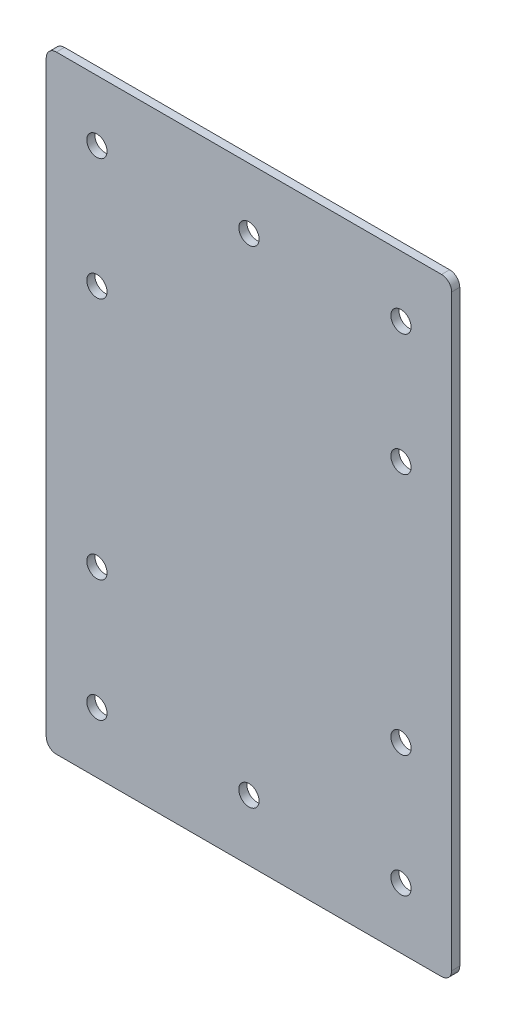
ISO-10303-21;
HEADER;
FILE_DESCRIPTION(('STEP AP214'),'2;1');
FILE_NAME('part.step','',(''),(''),'','','');
FILE_SCHEMA(('AUTOMOTIVE_DESIGN { 1 0 10303 214 1 1 1 1 }'));
ENDSEC;
DATA;
#1=APPLICATION_CONTEXT('core data for automotive mechanical design processes');
#2=APPLICATION_PROTOCOL_DEFINITION('international standard','automotive_design',2000,#1);
#3=PRODUCT_CONTEXT('',#1,'mechanical');
#4=PRODUCT('Part','Part','',(#3));
#5=PRODUCT_RELATED_PRODUCT_CATEGORY('part','',(#4));
#6=PRODUCT_DEFINITION_FORMATION('','',#4);
#7=PRODUCT_DEFINITION_CONTEXT('part definition',#1,'design');
#8=PRODUCT_DEFINITION('design','',#6,#7);
#9=PRODUCT_DEFINITION_SHAPE('','',#8);
#10=(LENGTH_UNIT() NAMED_UNIT(*) SI_UNIT(.MILLI.,.METRE.));
#11=(NAMED_UNIT(*) PLANE_ANGLE_UNIT() SI_UNIT($,.RADIAN.));
#12=(NAMED_UNIT(*) SI_UNIT($,.STERADIAN.) SOLID_ANGLE_UNIT());
#13=UNCERTAINTY_MEASURE_WITH_UNIT(LENGTH_MEASURE(1.E-05),#10,'distance_accuracy_value','');
#14=(GEOMETRIC_REPRESENTATION_CONTEXT(3) GLOBAL_UNCERTAINTY_ASSIGNED_CONTEXT((#13)) GLOBAL_UNIT_ASSIGNED_CONTEXT((#10,
#11,#12)) REPRESENTATION_CONTEXT('',''));
#15=CARTESIAN_POINT('',(0.,0.,0.));
#16=DIRECTION('',(0.,0.,1.));
#17=DIRECTION('',(1.,0.,0.));
#18=AXIS2_PLACEMENT_3D('',#15,#16,#17);
#19=CARTESIAN_POINT('',(499.999999999999,-150.,175.));
#20=DIRECTION('',(-1.,0.,0.));
#21=DIRECTION('',(0.,-1.,0.));
#22=AXIS2_PLACEMENT_3D('',#19,#20,#21);
#23=PLANE('',#22);
#24=DIRECTION('',(0.,1.,0.));
#25=VECTOR('',#24,1.);
#26=CARTESIAN_POINT('',(499.999999999999,-150.,179.));
#27=LINE('',#26,#25);
#28=CARTESIAN_POINT('',(499.999999999999,-95.,179.));
#29=VERTEX_POINT('',#28);
#30=CARTESIAN_POINT('',(499.999999999999,195.,179.));
#31=VERTEX_POINT('',#30);
#32=EDGE_CURVE('E128',#29,#31,#27,.T.);
#33=ORIENTED_EDGE('',*,*,#32,.F.);
#34=DIRECTION('',(0.,0.,1.));
#35=VECTOR('',#34,1.);
#36=CARTESIAN_POINT('',(499.999999999999,-95.,175.));
#37=LINE('',#36,#35);
#38=CARTESIAN_POINT('',(499.999999999999,-95.,175.));
#39=VERTEX_POINT('',#38);
#40=EDGE_CURVE('E147',#29,#39,#37,.F.);
#41=ORIENTED_EDGE('',*,*,#40,.T.);
#42=DIRECTION('',(0.,1.,0.));
#43=VECTOR('',#42,1.);
#44=CARTESIAN_POINT('',(499.999999999999,-150.,175.));
#45=LINE('',#44,#43);
#46=CARTESIAN_POINT('',(499.999999999999,195.,175.));
#47=VERTEX_POINT('',#46);
#48=EDGE_CURVE('E120',#39,#47,#45,.T.);
#49=ORIENTED_EDGE('',*,*,#48,.T.);
#50=DIRECTION('',(0.,0.,1.));
#51=VECTOR('',#50,1.);
#52=CARTESIAN_POINT('',(499.999999999999,195.,175.));
#53=LINE('',#52,#51);
#54=EDGE_CURVE('E108',#47,#31,#53,.T.);
#55=ORIENTED_EDGE('',*,*,#54,.T.);
#56=EDGE_LOOP('',(#33,#41,#49,#55));
#57=FACE_BOUND('',#56,.T.);
#58=ADVANCED_FACE('F34',(#57),#23,.F.);
#59=CARTESIAN_POINT('',(299.999999999999,-150.,179.));
#60=DIRECTION('',(0.,0.,-1.));
#61=DIRECTION('',(0.,1.,0.));
#62=AXIS2_PLACEMENT_3D('',#59,#60,#61);
#63=PLANE('',#62);
#64=CARTESIAN_POINT('',(325.000000000002,-70.,179.));
#65=DIRECTION('',(0.,0.,1.));
#66=DIRECTION('',(1.,0.,0.));
#67=AXIS2_PLACEMENT_3D('',#64,#65,#66);
#68=CIRCLE('',#67,5.00000000000005);
#69=CARTESIAN_POINT('',(330.000000000002,-70.,179.));
#70=VERTEX_POINT('',#69);
#71=EDGE_CURVE('E184',#70,#70,#68,.T.);
#72=ORIENTED_EDGE('',*,*,#71,.F.);
#73=EDGE_LOOP('',(#72));
#74=FACE_BOUND('',#73,.T.);
#75=CARTESIAN_POINT('',(325.,110.,179.));
#76=DIRECTION('',(0.,0.,1.));
#77=DIRECTION('',(1.,0.,0.));
#78=AXIS2_PLACEMENT_3D('',#75,#76,#77);
#79=CIRCLE('',#78,5.00000000000011);
#80=CARTESIAN_POINT('',(330.,110.,179.));
#81=VERTEX_POINT('',#80);
#82=EDGE_CURVE('E192',#81,#81,#79,.T.);
#83=ORIENTED_EDGE('',*,*,#82,.F.);
#84=EDGE_LOOP('',(#83));
#85=FACE_BOUND('',#84,.T.);
#86=CARTESIAN_POINT('',(475.,110.,179.));
#87=DIRECTION('',(0.,0.,1.));
#88=DIRECTION('',(1.,0.,0.));
#89=AXIS2_PLACEMENT_3D('',#86,#87,#88);
#90=CIRCLE('',#89,5.00000000000005);
#91=CARTESIAN_POINT('',(480.,110.,179.));
#92=VERTEX_POINT('',#91);
#93=EDGE_CURVE('E183',#92,#92,#90,.T.);
#94=ORIENTED_EDGE('',*,*,#93,.F.);
#95=EDGE_LOOP('',(#94));
#96=FACE_BOUND('',#95,.T.);
#97=CARTESIAN_POINT('',(475.000000000001,-9.99999999999997,179.));
#98=DIRECTION('',(0.,0.,1.));
#99=DIRECTION('',(1.,0.,0.));
#100=AXIS2_PLACEMENT_3D('',#97,#98,#99);
#101=CIRCLE('',#100,5.00000000000005);
#102=CARTESIAN_POINT('',(480.000000000001,-9.99999999999997,179.));
#103=VERTEX_POINT('',#102);
#104=EDGE_CURVE('E169',#103,#103,#101,.T.);
#105=ORIENTED_EDGE('',*,*,#104,.F.);
#106=EDGE_LOOP('',(#105));
#107=FACE_BOUND('',#106,.T.);
#108=CARTESIAN_POINT('',(325.000000000001,-9.99999999999997,179.));
#109=DIRECTION('',(0.,0.,1.));
#110=DIRECTION('',(1.,0.,0.));
#111=AXIS2_PLACEMENT_3D('',#108,#109,#110);
#112=CIRCLE('',#111,5.00000000000005);
#113=CARTESIAN_POINT('',(330.000000000001,-9.99999999999997,179.));
#114=VERTEX_POINT('',#113);
#115=EDGE_CURVE('E177',#114,#114,#112,.T.);
#116=ORIENTED_EDGE('',*,*,#115,.F.);
#117=EDGE_LOOP('',(#116));
#118=FACE_BOUND('',#117,.T.);
#119=CARTESIAN_POINT('',(399.999999999999,170.,179.));
#120=DIRECTION('',(0.,0.,1.));
#121=DIRECTION('',(1.,0.,0.));
#122=AXIS2_PLACEMENT_3D('',#119,#120,#121);
#123=CIRCLE('',#122,5.00000000000005);
#124=CARTESIAN_POINT('',(404.999999999999,170.,179.));
#125=VERTEX_POINT('',#124);
#126=EDGE_CURVE('E209',#125,#125,#123,.T.);
#127=ORIENTED_EDGE('',*,*,#126,.F.);
#128=EDGE_LOOP('',(#127));
#129=FACE_BOUND('',#128,.T.);
#130=CARTESIAN_POINT('',(474.999999999999,170.,179.));
#131=DIRECTION('',(0.,0.,1.));
#132=DIRECTION('',(1.,0.,0.));
#133=AXIS2_PLACEMENT_3D('',#130,#131,#132);
#134=CIRCLE('',#133,5.00000000000005);
#135=CARTESIAN_POINT('',(479.999999999999,170.,179.));
#136=VERTEX_POINT('',#135);
#137=EDGE_CURVE('E202',#136,#136,#134,.T.);
#138=ORIENTED_EDGE('',*,*,#137,.F.);
#139=EDGE_LOOP('',(#138));
#140=FACE_BOUND('',#139,.T.);
#141=CARTESIAN_POINT('',(400.000000000002,-70.,179.));
#142=DIRECTION('',(0.,0.,1.));
#143=DIRECTION('',(1.,0.,0.));
#144=AXIS2_PLACEMENT_3D('',#141,#142,#143);
#145=CIRCLE('',#144,5.00000000000005);
#146=CARTESIAN_POINT('',(405.000000000002,-70.,179.));
#147=VERTEX_POINT('',#146);
#148=EDGE_CURVE('E210',#147,#147,#145,.T.);
#149=ORIENTED_EDGE('',*,*,#148,.F.);
#150=EDGE_LOOP('',(#149));
#151=FACE_BOUND('',#150,.T.);
#152=CARTESIAN_POINT('',(475.000000000002,-70.,179.));
#153=DIRECTION('',(0.,0.,1.));
#154=DIRECTION('',(1.,0.,0.));
#155=AXIS2_PLACEMENT_3D('',#152,#153,#154);
#156=CIRCLE('',#155,5.00000000000005);
#157=CARTESIAN_POINT('',(480.000000000002,-70.,179.));
#158=VERTEX_POINT('',#157);
#159=EDGE_CURVE('E191',#158,#158,#156,.T.);
#160=ORIENTED_EDGE('',*,*,#159,.F.);
#161=EDGE_LOOP('',(#160));
#162=FACE_BOUND('',#161,.T.);
#163=CARTESIAN_POINT('',(324.999999999999,170.,179.));
#164=DIRECTION('',(0.,0.,1.));
#165=DIRECTION('',(1.,0.,0.));
#166=AXIS2_PLACEMENT_3D('',#163,#164,#165);
#167=CIRCLE('',#166,5.00000000000005);
#168=CARTESIAN_POINT('',(329.999999999999,170.,179.));
#169=VERTEX_POINT('',#168);
#170=EDGE_CURVE('E225',#169,#169,#167,.T.);
#171=ORIENTED_EDGE('',*,*,#170,.F.);
#172=EDGE_LOOP('',(#171));
#173=FACE_BOUND('',#172,.T.);
#174=DIRECTION('',(0.,1.,0.));
#175=VECTOR('',#174,1.);
#176=CARTESIAN_POINT('',(299.999999999999,-150.,179.));
#177=LINE('',#176,#175);
#178=CARTESIAN_POINT('',(299.999999999999,-95.,179.));
#179=VERTEX_POINT('',#178);
#180=CARTESIAN_POINT('',(299.999999999999,195.,179.));
#181=VERTEX_POINT('',#180);
#182=EDGE_CURVE('E119',#179,#181,#177,.T.);
#183=ORIENTED_EDGE('',*,*,#182,.F.);
#184=CARTESIAN_POINT('',(304.999999999999,-95.,179.));
#185=DIRECTION('',(0.,0.,-1.));
#186=DIRECTION('',(0.,1.,0.));
#187=AXIS2_PLACEMENT_3D('',#184,#185,#186);
#188=CIRCLE('',#187,5.);
#189=CARTESIAN_POINT('',(304.999999999999,-100.,179.));
#190=VERTEX_POINT('',#189);
#191=EDGE_CURVE('E123',#179,#190,#188,.F.);
#192=ORIENTED_EDGE('',*,*,#191,.T.);
#193=DIRECTION('',(-1.,0.,0.));
#194=VECTOR('',#193,1.);
#195=CARTESIAN_POINT('',(299.999999999999,-100.,179.));
#196=LINE('',#195,#194);
#197=CARTESIAN_POINT('',(494.999999999999,-100.,179.));
#198=VERTEX_POINT('',#197);
#199=EDGE_CURVE('E166',#198,#190,#196,.T.);
#200=ORIENTED_EDGE('',*,*,#199,.F.);
#201=CARTESIAN_POINT('',(494.999999999999,-95.,179.));
#202=DIRECTION('',(0.,0.,-1.));
#203=DIRECTION('',(0.,1.,0.));
#204=AXIS2_PLACEMENT_3D('',#201,#202,#203);
#205=CIRCLE('',#204,5.);
#206=EDGE_CURVE('E133',#198,#29,#205,.F.);
#207=ORIENTED_EDGE('',*,*,#206,.T.);
#208=ORIENTED_EDGE('',*,*,#32,.T.);
#209=CARTESIAN_POINT('',(494.999999999999,195.,179.));
#210=DIRECTION('',(0.,0.,-1.));
#211=DIRECTION('',(0.,1.,0.));
#212=AXIS2_PLACEMENT_3D('',#209,#210,#211);
#213=CIRCLE('',#212,5.);
#214=CARTESIAN_POINT('',(494.999999999999,200.,179.));
#215=VERTEX_POINT('',#214);
#216=EDGE_CURVE('E124',#31,#215,#213,.F.);
#217=ORIENTED_EDGE('',*,*,#216,.T.);
#218=DIRECTION('',(1.,0.,0.));
#219=VECTOR('',#218,1.);
#220=CARTESIAN_POINT('',(499.999999999999,200.,179.));
#221=LINE('',#220,#219);
#222=CARTESIAN_POINT('',(304.999999999999,200.,179.));
#223=VERTEX_POINT('',#222);
#224=EDGE_CURVE('E222',#223,#215,#221,.T.);
#225=ORIENTED_EDGE('',*,*,#224,.F.);
#226=CARTESIAN_POINT('',(304.999999999999,195.,179.));
#227=DIRECTION('',(0.,0.,-1.));
#228=DIRECTION('',(0.,1.,0.));
#229=AXIS2_PLACEMENT_3D('',#226,#227,#228);
#230=CIRCLE('',#229,5.);
#231=EDGE_CURVE('E126',#223,#181,#230,.F.);
#232=ORIENTED_EDGE('',*,*,#231,.T.);
#233=EDGE_LOOP('',(#183,#192,#200,#207,#208,#217,#225,#232));
#234=FACE_BOUND('',#233,.T.);
#235=ADVANCED_FACE('F168',(#74,#85,#96,#107,#118,#129,#140,#151,#162,#173,#234),#63,.F.);
#236=CARTESIAN_POINT('',(299.999999999999,-150.,175.));
#237=DIRECTION('',(1.,0.,0.));
#238=DIRECTION('',(0.,1.,0.));
#239=AXIS2_PLACEMENT_3D('',#236,#237,#238);
#240=PLANE('',#239);
#241=DIRECTION('',(0.,1.,0.));
#242=VECTOR('',#241,1.);
#243=CARTESIAN_POINT('',(299.999999999999,-150.,175.));
#244=LINE('',#243,#242);
#245=CARTESIAN_POINT('',(299.999999999999,-95.,175.));
#246=VERTEX_POINT('',#245);
#247=CARTESIAN_POINT('',(299.999999999999,195.,175.));
#248=VERTEX_POINT('',#247);
#249=EDGE_CURVE('E102',#246,#248,#244,.T.);
#250=ORIENTED_EDGE('',*,*,#249,.F.);
#251=DIRECTION('',(0.,0.,1.));
#252=VECTOR('',#251,1.);
#253=CARTESIAN_POINT('',(299.999999999999,-95.,175.));
#254=LINE('',#253,#252);
#255=EDGE_CURVE('E115',#246,#179,#254,.T.);
#256=ORIENTED_EDGE('',*,*,#255,.T.);
#257=ORIENTED_EDGE('',*,*,#182,.T.);
#258=DIRECTION('',(0.,0.,1.));
#259=VECTOR('',#258,1.);
#260=CARTESIAN_POINT('',(299.999999999999,195.,175.));
#261=LINE('',#260,#259);
#262=EDGE_CURVE('E118',#181,#248,#261,.F.);
#263=ORIENTED_EDGE('',*,*,#262,.T.);
#264=EDGE_LOOP('',(#250,#256,#257,#263));
#265=FACE_BOUND('',#264,.T.);
#266=ADVANCED_FACE('F113',(#265),#240,.F.);
#267=CARTESIAN_POINT('',(299.999999999999,-150.,175.));
#268=DIRECTION('',(0.,0.,1.));
#269=DIRECTION('',(0.,-1.,0.));
#270=AXIS2_PLACEMENT_3D('',#267,#268,#269);
#271=PLANE('',#270);
#272=CARTESIAN_POINT('',(325.000000000002,-70.,175.));
#273=DIRECTION('',(0.,0.,1.));
#274=DIRECTION('',(0.,-1.,0.));
#275=AXIS2_PLACEMENT_3D('',#272,#273,#274);
#276=CIRCLE('',#275,5.00000000000005);
#277=CARTESIAN_POINT('',(325.000000000002,-75.,175.));
#278=VERTEX_POINT('',#277);
#279=EDGE_CURVE('E187',#278,#278,#276,.F.);
#280=ORIENTED_EDGE('',*,*,#279,.F.);
#281=EDGE_LOOP('',(#280));
#282=FACE_BOUND('',#281,.T.);
#283=CARTESIAN_POINT('',(325.,110.,175.));
#284=DIRECTION('',(0.,0.,1.));
#285=DIRECTION('',(0.,-1.,0.));
#286=AXIS2_PLACEMENT_3D('',#283,#284,#285);
#287=CIRCLE('',#286,5.00000000000011);
#288=CARTESIAN_POINT('',(325.,105.,175.));
#289=VERTEX_POINT('',#288);
#290=EDGE_CURVE('E188',#289,#289,#287,.F.);
#291=ORIENTED_EDGE('',*,*,#290,.F.);
#292=EDGE_LOOP('',(#291));
#293=FACE_BOUND('',#292,.T.);
#294=CARTESIAN_POINT('',(475.,110.,175.));
#295=DIRECTION('',(0.,0.,1.));
#296=DIRECTION('',(0.,-1.,0.));
#297=AXIS2_PLACEMENT_3D('',#294,#295,#296);
#298=CIRCLE('',#297,5.00000000000005);
#299=CARTESIAN_POINT('',(475.,105.,175.));
#300=VERTEX_POINT('',#299);
#301=EDGE_CURVE('E195',#300,#300,#298,.F.);
#302=ORIENTED_EDGE('',*,*,#301,.F.);
#303=EDGE_LOOP('',(#302));
#304=FACE_BOUND('',#303,.T.);
#305=CARTESIAN_POINT('',(475.000000000001,-9.99999999999997,175.));
#306=DIRECTION('',(0.,0.,1.));
#307=DIRECTION('',(0.,-1.,0.));
#308=AXIS2_PLACEMENT_3D('',#305,#306,#307);
#309=CIRCLE('',#308,5.00000000000005);
#310=CARTESIAN_POINT('',(475.000000000001,-15.,175.));
#311=VERTEX_POINT('',#310);
#312=EDGE_CURVE('E172',#311,#311,#309,.F.);
#313=ORIENTED_EDGE('',*,*,#312,.F.);
#314=EDGE_LOOP('',(#313));
#315=FACE_BOUND('',#314,.T.);
#316=CARTESIAN_POINT('',(325.000000000001,-9.99999999999997,175.));
#317=DIRECTION('',(0.,0.,1.));
#318=DIRECTION('',(0.,-1.,0.));
#319=AXIS2_PLACEMENT_3D('',#316,#317,#318);
#320=CIRCLE('',#319,5.00000000000005);
#321=CARTESIAN_POINT('',(325.000000000001,-15.,175.));
#322=VERTEX_POINT('',#321);
#323=EDGE_CURVE('E180',#322,#322,#320,.F.);
#324=ORIENTED_EDGE('',*,*,#323,.F.);
#325=EDGE_LOOP('',(#324));
#326=FACE_BOUND('',#325,.T.);
#327=CARTESIAN_POINT('',(399.999999999999,170.,175.));
#328=DIRECTION('',(0.,0.,1.));
#329=DIRECTION('',(0.,-1.,0.));
#330=AXIS2_PLACEMENT_3D('',#327,#328,#329);
#331=CIRCLE('',#330,5.00000000000005);
#332=CARTESIAN_POINT('',(399.999999999999,165.,175.));
#333=VERTEX_POINT('',#332);
#334=EDGE_CURVE('E223',#333,#333,#331,.F.);
#335=ORIENTED_EDGE('',*,*,#334,.F.);
#336=EDGE_LOOP('',(#335));
#337=FACE_BOUND('',#336,.T.);
#338=CARTESIAN_POINT('',(474.999999999999,170.,175.));
#339=DIRECTION('',(0.,0.,1.));
#340=DIRECTION('',(0.,-1.,0.));
#341=AXIS2_PLACEMENT_3D('',#338,#339,#340);
#342=CIRCLE('',#341,5.00000000000005);
#343=CARTESIAN_POINT('',(474.999999999999,165.,175.));
#344=VERTEX_POINT('',#343);
#345=EDGE_CURVE('E205',#344,#344,#342,.F.);
#346=ORIENTED_EDGE('',*,*,#345,.F.);
#347=EDGE_LOOP('',(#346));
#348=FACE_BOUND('',#347,.T.);
#349=CARTESIAN_POINT('',(400.000000000002,-70.,175.));
#350=DIRECTION('',(0.,0.,1.));
#351=DIRECTION('',(0.,-1.,0.));
#352=AXIS2_PLACEMENT_3D('',#349,#350,#351);
#353=CIRCLE('',#352,5.00000000000005);
#354=CARTESIAN_POINT('',(400.000000000002,-75.,175.));
#355=VERTEX_POINT('',#354);
#356=EDGE_CURVE('E206',#355,#355,#353,.F.);
#357=ORIENTED_EDGE('',*,*,#356,.F.);
#358=EDGE_LOOP('',(#357));
#359=FACE_BOUND('',#358,.T.);
#360=CARTESIAN_POINT('',(475.000000000002,-70.,175.));
#361=DIRECTION('',(0.,0.,1.));
#362=DIRECTION('',(0.,-1.,0.));
#363=AXIS2_PLACEMENT_3D('',#360,#361,#362);
#364=CIRCLE('',#363,5.00000000000005);
#365=CARTESIAN_POINT('',(475.000000000002,-75.,175.));
#366=VERTEX_POINT('',#365);
#367=EDGE_CURVE('E213',#366,#366,#364,.F.);
#368=ORIENTED_EDGE('',*,*,#367,.F.);
#369=EDGE_LOOP('',(#368));
#370=FACE_BOUND('',#369,.T.);
#371=CARTESIAN_POINT('',(324.999999999999,170.,175.));
#372=DIRECTION('',(0.,0.,1.));
#373=DIRECTION('',(0.,-1.,0.));
#374=AXIS2_PLACEMENT_3D('',#371,#372,#373);
#375=CIRCLE('',#374,5.00000000000005);
#376=CARTESIAN_POINT('',(324.999999999999,165.,175.));
#377=VERTEX_POINT('',#376);
#378=EDGE_CURVE('E158',#377,#377,#375,.F.);
#379=ORIENTED_EDGE('',*,*,#378,.F.);
#380=EDGE_LOOP('',(#379));
#381=FACE_BOUND('',#380,.T.);
#382=DIRECTION('',(1.,0.,0.));
#383=VECTOR('',#382,1.);
#384=CARTESIAN_POINT('',(299.999999999999,-100.,175.));
#385=LINE('',#384,#383);
#386=CARTESIAN_POINT('',(304.999999999999,-100.,175.));
#387=VERTEX_POINT('',#386);
#388=CARTESIAN_POINT('',(494.999999999999,-100.,175.));
#389=VERTEX_POINT('',#388);
#390=EDGE_CURVE('E104',#387,#389,#385,.T.);
#391=ORIENTED_EDGE('',*,*,#390,.F.);
#392=CARTESIAN_POINT('',(304.999999999999,-95.,175.));
#393=DIRECTION('',(0.,0.,1.));
#394=DIRECTION('',(0.,-1.,0.));
#395=AXIS2_PLACEMENT_3D('',#392,#393,#394);
#396=CIRCLE('',#395,5.);
#397=EDGE_CURVE('E99',#387,#246,#396,.F.);
#398=ORIENTED_EDGE('',*,*,#397,.T.);
#399=ORIENTED_EDGE('',*,*,#249,.T.);
#400=CARTESIAN_POINT('',(304.999999999999,195.,175.));
#401=DIRECTION('',(0.,0.,1.));
#402=DIRECTION('',(0.,-1.,0.));
#403=AXIS2_PLACEMENT_3D('',#400,#401,#402);
#404=CIRCLE('',#403,5.);
#405=CARTESIAN_POINT('',(304.999999999999,200.,175.));
#406=VERTEX_POINT('',#405);
#407=EDGE_CURVE('E49',#248,#406,#404,.F.);
#408=ORIENTED_EDGE('',*,*,#407,.T.);
#409=DIRECTION('',(-1.,0.,0.));
#410=VECTOR('',#409,1.);
#411=CARTESIAN_POINT('',(499.999999999999,200.,175.));
#412=LINE('',#411,#410);
#413=CARTESIAN_POINT('',(494.999999999999,200.,175.));
#414=VERTEX_POINT('',#413);
#415=EDGE_CURVE('E220',#414,#406,#412,.T.);
#416=ORIENTED_EDGE('',*,*,#415,.F.);
#417=CARTESIAN_POINT('',(494.999999999999,195.,175.));
#418=DIRECTION('',(0.,0.,1.));
#419=DIRECTION('',(0.,-1.,0.));
#420=AXIS2_PLACEMENT_3D('',#417,#418,#419);
#421=CIRCLE('',#420,5.);
#422=EDGE_CURVE('E141',#414,#47,#421,.F.);
#423=ORIENTED_EDGE('',*,*,#422,.T.);
#424=ORIENTED_EDGE('',*,*,#48,.F.);
#425=CARTESIAN_POINT('',(494.999999999999,-95.,175.));
#426=DIRECTION('',(0.,0.,1.));
#427=DIRECTION('',(0.,-1.,0.));
#428=AXIS2_PLACEMENT_3D('',#425,#426,#427);
#429=CIRCLE('',#428,5.);
#430=EDGE_CURVE('E109',#39,#389,#429,.F.);
#431=ORIENTED_EDGE('',*,*,#430,.T.);
#432=EDGE_LOOP('',(#391,#398,#399,#408,#416,#423,#424,#431));
#433=FACE_BOUND('',#432,.T.);
#434=ADVANCED_FACE('F101',(#282,#293,#304,#315,#326,#337,#348,#359,#370,#381,#433),#271,.F.);
#435=CARTESIAN_POINT('',(324.999999999999,170.,-75.001));
#436=DIRECTION('',(0.,0.,1.));
#437=DIRECTION('',(1.,0.,0.));
#438=AXIS2_PLACEMENT_3D('',#435,#436,#437);
#439=CYLINDRICAL_SURFACE('',#438,5.00000000000005);
#440=ORIENTED_EDGE('',*,*,#170,.T.);
#441=EDGE_LOOP('',(#440));
#442=FACE_BOUND('',#441,.T.);
#443=ORIENTED_EDGE('',*,*,#378,.T.);
#444=EDGE_LOOP('',(#443));
#445=FACE_BOUND('',#444,.T.);
#446=ADVANCED_FACE('F371',(#442,#445),#439,.F.);
#447=CARTESIAN_POINT('',(475.000000000002,-70.,-75.001));
#448=DIRECTION('',(0.,0.,1.));
#449=DIRECTION('',(1.,0.,0.));
#450=AXIS2_PLACEMENT_3D('',#447,#448,#449);
#451=CYLINDRICAL_SURFACE('',#450,5.00000000000005);
#452=ORIENTED_EDGE('',*,*,#159,.T.);
#453=EDGE_LOOP('',(#452));
#454=FACE_BOUND('',#453,.T.);
#455=ORIENTED_EDGE('',*,*,#367,.T.);
#456=EDGE_LOOP('',(#455));
#457=FACE_BOUND('',#456,.T.);
#458=ADVANCED_FACE('F362',(#454,#457),#451,.F.);
#459=CARTESIAN_POINT('',(400.000000000002,-70.,-75.001));
#460=DIRECTION('',(0.,0.,1.));
#461=DIRECTION('',(1.,0.,0.));
#462=AXIS2_PLACEMENT_3D('',#459,#460,#461);
#463=CYLINDRICAL_SURFACE('',#462,5.00000000000005);
#464=ORIENTED_EDGE('',*,*,#148,.T.);
#465=EDGE_LOOP('',(#464));
#466=FACE_BOUND('',#465,.T.);
#467=ORIENTED_EDGE('',*,*,#356,.T.);
#468=EDGE_LOOP('',(#467));
#469=FACE_BOUND('',#468,.T.);
#470=ADVANCED_FACE('F353',(#466,#469),#463,.F.);
#471=CARTESIAN_POINT('',(474.999999999999,170.,-75.001));
#472=DIRECTION('',(0.,0.,1.));
#473=DIRECTION('',(1.,0.,0.));
#474=AXIS2_PLACEMENT_3D('',#471,#472,#473);
#475=CYLINDRICAL_SURFACE('',#474,5.00000000000005);
#476=ORIENTED_EDGE('',*,*,#137,.T.);
#477=EDGE_LOOP('',(#476));
#478=FACE_BOUND('',#477,.T.);
#479=ORIENTED_EDGE('',*,*,#345,.T.);
#480=EDGE_LOOP('',(#479));
#481=FACE_BOUND('',#480,.T.);
#482=ADVANCED_FACE('F344',(#478,#481),#475,.F.);
#483=CARTESIAN_POINT('',(399.999999999999,170.,-75.001));
#484=DIRECTION('',(0.,0.,1.));
#485=DIRECTION('',(1.,0.,0.));
#486=AXIS2_PLACEMENT_3D('',#483,#484,#485);
#487=CYLINDRICAL_SURFACE('',#486,5.00000000000005);
#488=ORIENTED_EDGE('',*,*,#126,.T.);
#489=EDGE_LOOP('',(#488));
#490=FACE_BOUND('',#489,.T.);
#491=ORIENTED_EDGE('',*,*,#334,.T.);
#492=EDGE_LOOP('',(#491));
#493=FACE_BOUND('',#492,.T.);
#494=ADVANCED_FACE('F336',(#490,#493),#487,.F.);
#495=CARTESIAN_POINT('',(499.999999999999,200.,-75.001));
#496=DIRECTION('',(0.,-1.,0.));
#497=DIRECTION('',(0.,0.,-1.));
#498=AXIS2_PLACEMENT_3D('',#495,#496,#497);
#499=PLANE('',#498);
#500=ORIENTED_EDGE('',*,*,#415,.T.);
#501=DIRECTION('',(0.,0.,1.));
#502=VECTOR('',#501,1.);
#503=CARTESIAN_POINT('',(304.999999999999,200.,-75.001));
#504=LINE('',#503,#502);
#505=EDGE_CURVE('E11',#406,#223,#504,.T.);
#506=ORIENTED_EDGE('',*,*,#505,.T.);
#507=ORIENTED_EDGE('',*,*,#224,.T.);
#508=DIRECTION('',(0.,0.,1.));
#509=VECTOR('',#508,1.);
#510=CARTESIAN_POINT('',(494.999999999999,200.,-75.001));
#511=LINE('',#510,#509);
#512=EDGE_CURVE('E42',#215,#414,#511,.F.);
#513=ORIENTED_EDGE('',*,*,#512,.T.);
#514=EDGE_LOOP('',(#500,#506,#507,#513));
#515=FACE_BOUND('',#514,.T.);
#516=ADVANCED_FACE('F236',(#515),#499,.F.);
#517=CARTESIAN_POINT('',(325.000000000001,-9.99999999999997,-75.001));
#518=DIRECTION('',(0.,0.,1.));
#519=DIRECTION('',(1.,0.,0.));
#520=AXIS2_PLACEMENT_3D('',#517,#518,#519);
#521=CYLINDRICAL_SURFACE('',#520,5.00000000000005);
#522=ORIENTED_EDGE('',*,*,#115,.T.);
#523=EDGE_LOOP('',(#522));
#524=FACE_BOUND('',#523,.T.);
#525=ORIENTED_EDGE('',*,*,#323,.T.);
#526=EDGE_LOOP('',(#525));
#527=FACE_BOUND('',#526,.T.);
#528=ADVANCED_FACE('F319',(#524,#527),#521,.F.);
#529=CARTESIAN_POINT('',(475.000000000001,-9.99999999999997,-75.001));
#530=DIRECTION('',(0.,0.,1.));
#531=DIRECTION('',(1.,0.,0.));
#532=AXIS2_PLACEMENT_3D('',#529,#530,#531);
#533=CYLINDRICAL_SURFACE('',#532,5.00000000000005);
#534=ORIENTED_EDGE('',*,*,#104,.T.);
#535=EDGE_LOOP('',(#534));
#536=FACE_BOUND('',#535,.T.);
#537=ORIENTED_EDGE('',*,*,#312,.T.);
#538=EDGE_LOOP('',(#537));
#539=FACE_BOUND('',#538,.T.);
#540=ADVANCED_FACE('F311',(#536,#539),#533,.F.);
#541=CARTESIAN_POINT('',(299.999999999999,-100.,-75.001));
#542=DIRECTION('',(0.,1.,0.));
#543=DIRECTION('',(0.,0.,1.));
#544=AXIS2_PLACEMENT_3D('',#541,#542,#543);
#545=PLANE('',#544);
#546=ORIENTED_EDGE('',*,*,#199,.T.);
#547=DIRECTION('',(0.,0.,1.));
#548=VECTOR('',#547,1.);
#549=CARTESIAN_POINT('',(304.999999999999,-100.,-75.001));
#550=LINE('',#549,#548);
#551=EDGE_CURVE('E139',#190,#387,#550,.F.);
#552=ORIENTED_EDGE('',*,*,#551,.T.);
#553=ORIENTED_EDGE('',*,*,#390,.T.);
#554=DIRECTION('',(0.,0.,1.));
#555=VECTOR('',#554,1.);
#556=CARTESIAN_POINT('',(494.999999999999,-100.,-75.001));
#557=LINE('',#556,#555);
#558=EDGE_CURVE('E136',#389,#198,#557,.T.);
#559=ORIENTED_EDGE('',*,*,#558,.T.);
#560=EDGE_LOOP('',(#546,#552,#553,#559));
#561=FACE_BOUND('',#560,.T.);
#562=ADVANCED_FACE('F165',(#561),#545,.F.);
#563=CARTESIAN_POINT('',(475.,110.,-75.001));
#564=DIRECTION('',(0.,0.,1.));
#565=DIRECTION('',(1.,0.,0.));
#566=AXIS2_PLACEMENT_3D('',#563,#564,#565);
#567=CYLINDRICAL_SURFACE('',#566,5.00000000000005);
#568=ORIENTED_EDGE('',*,*,#93,.T.);
#569=EDGE_LOOP('',(#568));
#570=FACE_BOUND('',#569,.T.);
#571=ORIENTED_EDGE('',*,*,#301,.T.);
#572=EDGE_LOOP('',(#571));
#573=FACE_BOUND('',#572,.T.);
#574=ADVANCED_FACE('F294',(#570,#573),#567,.F.);
#575=CARTESIAN_POINT('',(325.,110.,-75.001));
#576=DIRECTION('',(0.,0.,1.));
#577=DIRECTION('',(1.,0.,0.));
#578=AXIS2_PLACEMENT_3D('',#575,#576,#577);
#579=CYLINDRICAL_SURFACE('',#578,5.00000000000011);
#580=ORIENTED_EDGE('',*,*,#82,.T.);
#581=EDGE_LOOP('',(#580));
#582=FACE_BOUND('',#581,.T.);
#583=ORIENTED_EDGE('',*,*,#290,.T.);
#584=EDGE_LOOP('',(#583));
#585=FACE_BOUND('',#584,.T.);
#586=ADVANCED_FACE('F285',(#582,#585),#579,.F.);
#587=CARTESIAN_POINT('',(325.000000000002,-70.,-75.001));
#588=DIRECTION('',(0.,0.,1.));
#589=DIRECTION('',(1.,0.,0.));
#590=AXIS2_PLACEMENT_3D('',#587,#588,#589);
#591=CYLINDRICAL_SURFACE('',#590,5.00000000000005);
#592=ORIENTED_EDGE('',*,*,#71,.T.);
#593=EDGE_LOOP('',(#592));
#594=FACE_BOUND('',#593,.T.);
#595=ORIENTED_EDGE('',*,*,#279,.T.);
#596=EDGE_LOOP('',(#595));
#597=FACE_BOUND('',#596,.T.);
#598=ADVANCED_FACE('F255',(#594,#597),#591,.F.);
#599=CARTESIAN_POINT('',(304.999999999999,-95.,175.));
#600=DIRECTION('',(0.,0.,1.));
#601=DIRECTION('',(1.,0.,0.));
#602=AXIS2_PLACEMENT_3D('',#599,#600,#601);
#603=CYLINDRICAL_SURFACE('',#602,5.);
#604=ORIENTED_EDGE('',*,*,#397,.F.);
#605=ORIENTED_EDGE('',*,*,#551,.F.);
#606=ORIENTED_EDGE('',*,*,#191,.F.);
#607=ORIENTED_EDGE('',*,*,#255,.F.);
#608=EDGE_LOOP('',(#604,#605,#606,#607));
#609=FACE_BOUND('',#608,.T.);
#610=ADVANCED_FACE('F122',(#609),#603,.T.);
#611=CARTESIAN_POINT('',(494.999999999999,-95.,-75.001));
#612=DIRECTION('',(0.,0.,1.));
#613=DIRECTION('',(1.,0.,0.));
#614=AXIS2_PLACEMENT_3D('',#611,#612,#613);
#615=CYLINDRICAL_SURFACE('',#614,5.);
#616=ORIENTED_EDGE('',*,*,#430,.F.);
#617=ORIENTED_EDGE('',*,*,#40,.F.);
#618=ORIENTED_EDGE('',*,*,#206,.F.);
#619=ORIENTED_EDGE('',*,*,#558,.F.);
#620=EDGE_LOOP('',(#616,#617,#618,#619));
#621=FACE_BOUND('',#620,.T.);
#622=ADVANCED_FACE('F161',(#621),#615,.T.);
#623=CARTESIAN_POINT('',(304.999999999999,195.,-75.001));
#624=DIRECTION('',(0.,0.,1.));
#625=DIRECTION('',(1.,0.,0.));
#626=AXIS2_PLACEMENT_3D('',#623,#624,#625);
#627=CYLINDRICAL_SURFACE('',#626,5.);
#628=ORIENTED_EDGE('',*,*,#407,.F.);
#629=ORIENTED_EDGE('',*,*,#262,.F.);
#630=ORIENTED_EDGE('',*,*,#231,.F.);
#631=ORIENTED_EDGE('',*,*,#505,.F.);
#632=EDGE_LOOP('',(#628,#629,#630,#631));
#633=FACE_BOUND('',#632,.T.);
#634=ADVANCED_FACE('F239',(#633),#627,.T.);
#635=CARTESIAN_POINT('',(494.999999999999,195.,175.));
#636=DIRECTION('',(0.,0.,1.));
#637=DIRECTION('',(1.,0.,0.));
#638=AXIS2_PLACEMENT_3D('',#635,#636,#637);
#639=CYLINDRICAL_SURFACE('',#638,5.);
#640=ORIENTED_EDGE('',*,*,#422,.F.);
#641=ORIENTED_EDGE('',*,*,#512,.F.);
#642=ORIENTED_EDGE('',*,*,#216,.F.);
#643=ORIENTED_EDGE('',*,*,#54,.F.);
#644=EDGE_LOOP('',(#640,#641,#642,#643));
#645=FACE_BOUND('',#644,.T.);
#646=ADVANCED_FACE('F36',(#645),#639,.T.);
#647=CLOSED_SHELL('',(#58,#235,#266,#434,#446,#458,#470,#482,#494,#516,#528,#540,#562,#574,#586,
#598,#610,#622,#634,#646));
#648=MANIFOLD_SOLID_BREP('B2',#647);
#649=ADVANCED_BREP_SHAPE_REPRESENTATION('',(#18,#648),#14);
#650=SHAPE_DEFINITION_REPRESENTATION(#9,#649);
ENDSEC;
END-ISO-10303-21;
